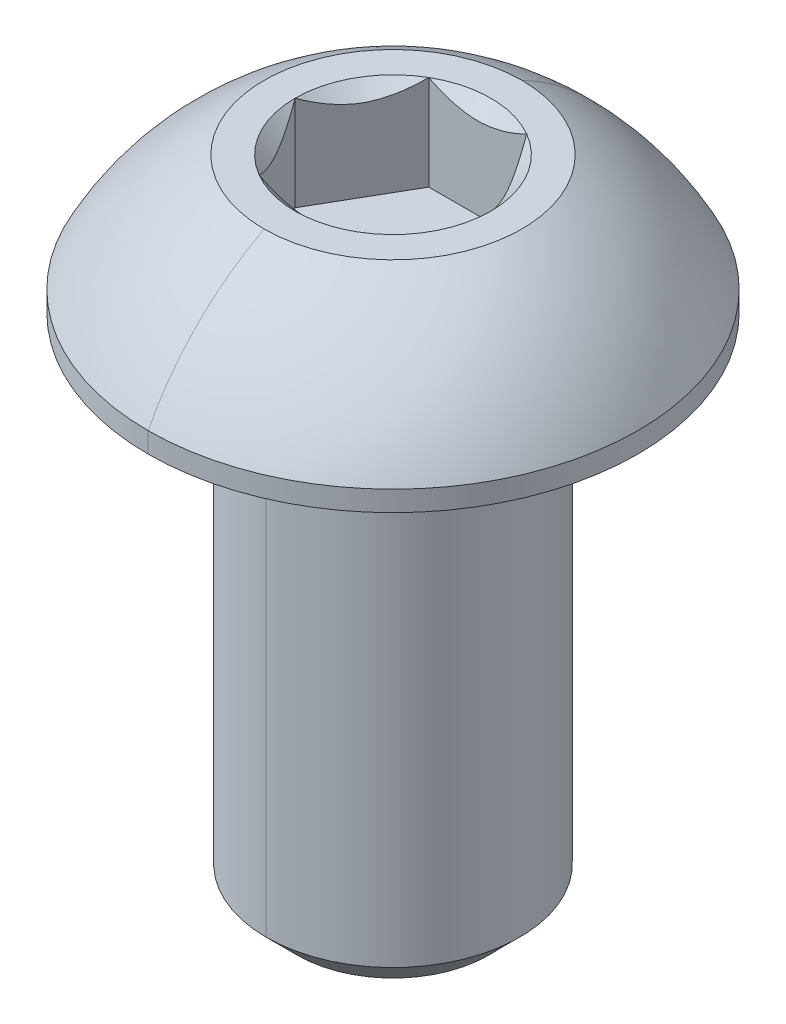
ISO-10303-21;
HEADER;
FILE_DESCRIPTION(('STEP AP214'),'2;1');
FILE_NAME('part.step','',(''),(''),'','','');
FILE_SCHEMA(('AUTOMOTIVE_DESIGN { 1 0 10303 214 1 1 1 1 }'));
ENDSEC;
DATA;
#1=APPLICATION_CONTEXT('core data for automotive mechanical design processes');
#2=APPLICATION_PROTOCOL_DEFINITION('international standard','automotive_design',2000,#1);
#3=PRODUCT_CONTEXT('',#1,'mechanical');
#4=PRODUCT('Part','Part','',(#3));
#5=PRODUCT_RELATED_PRODUCT_CATEGORY('part','',(#4));
#6=PRODUCT_DEFINITION_FORMATION('','',#4);
#7=PRODUCT_DEFINITION_CONTEXT('part definition',#1,'design');
#8=PRODUCT_DEFINITION('design','',#6,#7);
#9=PRODUCT_DEFINITION_SHAPE('','',#8);
#10=(LENGTH_UNIT() NAMED_UNIT(*) SI_UNIT(.MILLI.,.METRE.));
#11=(NAMED_UNIT(*) PLANE_ANGLE_UNIT() SI_UNIT($,.RADIAN.));
#12=(NAMED_UNIT(*) SI_UNIT($,.STERADIAN.) SOLID_ANGLE_UNIT());
#13=UNCERTAINTY_MEASURE_WITH_UNIT(LENGTH_MEASURE(1.E-05),#10,'distance_accuracy_value','');
#14=(GEOMETRIC_REPRESENTATION_CONTEXT(3) GLOBAL_UNCERTAINTY_ASSIGNED_CONTEXT((#13)) GLOBAL_UNIT_ASSIGNED_CONTEXT((#10,
#11,#12)) REPRESENTATION_CONTEXT('',''));
#15=CARTESIAN_POINT('',(0.,0.,0.));
#16=DIRECTION('',(0.,0.,1.));
#17=DIRECTION('',(1.,0.,0.));
#18=AXIS2_PLACEMENT_3D('',#15,#16,#17);
#19=CARTESIAN_POINT('',(2.83106871279415E-12,-0.152400000000052,-6.93889390390723E-13));
#20=DIRECTION('',(0.,1.,0.));
#21=DIRECTION('',(0.,0.,1.));
#22=AXIS2_PLACEMENT_3D('',#19,#20,#21);
#23=TOROIDAL_SURFACE('',#22,2.5273,0.1524);
#24=CARTESIAN_POINT('',(2.8832867508072E-12,-0.152400000000065,-2.52730000000004));
#25=DIRECTION('',(1.,0.,0.));
#26=DIRECTION('',(0.,1.,0.));
#27=AXIS2_PLACEMENT_3D('',#24,#25,#26);
#28=CIRCLE('',#27,0.1524);
#29=CARTESIAN_POINT('',(2.88750824063157E-12,0.,-2.5272999999997));
#30=VERTEX_POINT('',#29);
#31=CARTESIAN_POINT('',(8.02568049420078E-12,-0.152400000000048,-2.3749000000007));
#32=VERTEX_POINT('',#31);
#33=EDGE_CURVE('E258',#30,#32,#28,.T.);
#34=ORIENTED_EDGE('',*,*,#33,.F.);
#35=CARTESIAN_POINT('',(0.,0.,0.));
#36=DIRECTION('',(0.,1.,0.));
#37=DIRECTION('',(0.,0.,1.));
#38=AXIS2_PLACEMENT_3D('',#35,#36,#37);
#39=CIRCLE('',#38,2.52729999999935);
#40=CARTESIAN_POINT('',(2.78338166959102E-12,0.,2.527299999999));
#41=VERTEX_POINT('',#40);
#42=EDGE_CURVE('E182',#41,#30,#39,.T.);
#43=ORIENTED_EDGE('',*,*,#42,.F.);
#44=CARTESIAN_POINT('',(2.77916017976665E-12,-0.15240000000004,2.52729999999866));
#45=DIRECTION('',(-1.,0.,0.));
#46=DIRECTION('',(0.,-1.,0.));
#47=AXIS2_PLACEMENT_3D('',#44,#45,#46);
#48=CIRCLE('',#47,0.1524);
#49=CARTESIAN_POINT('',(2.78229034256228E-12,-0.152400000000041,2.3748999999987));
#50=VERTEX_POINT('',#49);
#51=EDGE_CURVE('E249',#41,#50,#48,.T.);
#52=ORIENTED_EDGE('',*,*,#51,.T.);
#53=CARTESIAN_POINT('',(2.83106871279415E-12,-0.152400000000052,-6.93889390390723E-13));
#54=DIRECTION('',(0.,-1.,0.));
#55=DIRECTION('',(0.,0.,1.));
#56=AXIS2_PLACEMENT_3D('',#53,#54,#55);
#57=CIRCLE('',#56,2.37489999999939);
#58=EDGE_CURVE('E235',#32,#50,#57,.T.);
#59=ORIENTED_EDGE('',*,*,#58,.F.);
#60=EDGE_LOOP('',(#34,#43,#52,#59));
#61=FACE_BOUND('',#60,.T.);
#62=ADVANCED_FACE('F16',(#61),#23,.F.);
#63=CARTESIAN_POINT('',(3.98292510084275E-12,2.56539999999183,0.));
#64=DIRECTION('',(0.,1.,0.));
#65=DIRECTION('',(0.,0.,1.));
#66=AXIS2_PLACEMENT_3D('',#63,#64,#65);
#67=CONICAL_SURFACE('',#66,1.83308710467659,0.78539816339745);
#68=DIRECTION('',(0.,0.707106781186531,-0.707106781186564));
#69=VECTOR('',#68,1.);
#70=CARTESIAN_POINT('',(4.02079959619876E-12,2.56539999999183,-1.83308710467666));
#71=LINE('',#70,#69);
#72=CARTESIAN_POINT('',(1.8249290967276E-12,0.732312895322496,-8.04911692853239E-13));
#73=VERTEX_POINT('',#72);
#74=CARTESIAN_POINT('',(3.93481257343155E-12,0.7874,-0.0550871046847421));
#75=VERTEX_POINT('',#74);
#76=EDGE_CURVE('E248',#73,#75,#71,.T.);
#77=ORIENTED_EDGE('',*,*,#76,.F.);
#78=DIRECTION('',(0.,0.707106781186533,0.707106781186562));
#79=VECTOR('',#78,1.);
#80=CARTESIAN_POINT('',(3.94527509391227E-12,2.56539999999184,1.83308710467652));
#81=LINE('',#80,#79);
#82=CARTESIAN_POINT('',(3.93254294524362E-12,0.7874,0.0550871046845962));
#83=VERTEX_POINT('',#82);
#84=EDGE_CURVE('E244',#73,#83,#81,.T.);
#85=ORIENTED_EDGE('',*,*,#84,.T.);
#86=CARTESIAN_POINT('',(9.29811783123569E-12,0.7874,-7.49400541621981E-13));
#87=DIRECTION('',(0.,1.,0.));
#88=DIRECTION('',(0.,0.,1.));
#89=AXIS2_PLACEMENT_3D('',#86,#87,#88);
#90=CIRCLE('',#89,0.0550871046770416);
#91=EDGE_CURVE('E265',#83,#75,#90,.T.);
#92=ORIENTED_EDGE('',*,*,#91,.T.);
#93=EDGE_LOOP('',(#77,#85,#92));
#94=FACE_BOUND('',#93,.T.);
#95=ADVANCED_FACE('F308',(#94),#67,.F.);
#96=CARTESIAN_POINT('',(1.83308710467573,0.787400000002103,5.27355936696949E-13));
#97=DIRECTION('',(0.86602540378436,0.,-0.500000000000136));
#98=DIRECTION('',(0.,-1.,0.));
#99=AXIS2_PLACEMENT_3D('',#96,#97,#98);
#100=PLANE('',#99);
#101=DIRECTION('',(0.,1.,0.));
#102=VECTOR('',#101,1.);
#103=CARTESIAN_POINT('',(1.83308710467573,0.787400000002103,5.27355936696949E-13));
#104=LINE('',#103,#102);
#105=CARTESIAN_POINT('',(1.83308710467573,0.787400000002103,5.27355936696949E-13));
#106=VERTEX_POINT('',#105);
#107=CARTESIAN_POINT('',(1.83308710467378,2.56539999999638,3.66373598126302E-12));
#108=VERTEX_POINT('',#107);
#109=EDGE_CURVE('E11',#106,#108,#104,.T.);
#110=ORIENTED_EDGE('',*,*,#109,.T.);
#111=CARTESIAN_POINT('',(1.83308710467658,2.56539999999639,2.04862599755152E-12));
#112=CARTESIAN_POINT('',(1.58854939318227,2.32086228847022,-0.423551740672565));
#113=CARTESIAN_POINT('',(1.37650342717792,2.31981648545018,-0.790826127331997));
#114=CARTESIAN_POINT('',(1.16317917434986,2.31876437796585,-1.16031457171672));
#115=CARTESIAN_POINT('',(0.916543552336051,2.56539999999961,-1.58750000000084));
#116=B_SPLINE_CURVE_WITH_KNOTS('',2,(#111,#112,#113,#114,#115),.UNSPECIFIED.,.F.,.F.,(3,2,3),
(0.,0.5,1.),.UNSPECIFIED.);
#117=CARTESIAN_POINT('',(0.916543552339173,2.5653999999996,-1.58750000000264));
#118=VERTEX_POINT('',#117);
#119=EDGE_CURVE('E290',#108,#118,#116,.T.);
#120=ORIENTED_EDGE('',*,*,#119,.T.);
#121=DIRECTION('',(0.,1.,0.));
#122=VECTOR('',#121,1.);
#123=CARTESIAN_POINT('',(0.916543552343552,0.787399999997551,-1.58750000000298));
#124=LINE('',#123,#122);
#125=CARTESIAN_POINT('',(0.916543552343552,0.787399999997551,-1.58750000000298));
#126=VERTEX_POINT('',#125);
#127=EDGE_CURVE('E340',#126,#118,#124,.T.);
#128=ORIENTED_EDGE('',*,*,#127,.F.);
#129=DIRECTION('',(-0.500000000000136,0.,-0.86602540378436));
#130=VECTOR('',#129,1.);
#131=CARTESIAN_POINT('',(1.83308710467573,0.787400000002103,5.27355936696949E-13));
#132=LINE('',#131,#130);
#133=EDGE_CURVE('E559',#106,#126,#132,.T.);
#134=ORIENTED_EDGE('',*,*,#133,.F.);
#135=EDGE_LOOP('',(#110,#120,#128,#134));
#136=FACE_BOUND('',#135,.T.);
#137=ADVANCED_FACE('F297',(#136),#100,.F.);
#138=CARTESIAN_POINT('',(0.916543552335766,0.787399999997222,1.58749999999671));
#139=DIRECTION('',(0.86602540378436,0.,0.500000000000136));
#140=DIRECTION('',(0.,-1.,0.));
#141=AXIS2_PLACEMENT_3D('',#138,#139,#140);
#142=PLANE('',#141);
#143=DIRECTION('',(0.,1.,0.));
#144=VECTOR('',#143,1.);
#145=CARTESIAN_POINT('',(0.916543552335766,0.787399999997222,1.58749999999671));
#146=LINE('',#145,#144);
#147=CARTESIAN_POINT('',(0.916543552335766,0.787399999997222,1.58749999999671));
#148=VERTEX_POINT('',#147);
#149=CARTESIAN_POINT('',(0.916543552334878,2.56539999999506,1.58749999999603));
#150=VERTEX_POINT('',#149);
#151=EDGE_CURVE('E29',#148,#150,#146,.T.);
#152=ORIENTED_EDGE('',*,*,#151,.T.);
#153=CARTESIAN_POINT('',(0.916543552335807,2.56539999999506,1.58749999999656));
#154=CARTESIAN_POINT('',(1.16108126382824,2.32086228846858,1.1639482593252));
#155=CARTESIAN_POINT('',(1.3731272298324,2.31981648544734,0.79667387266612));
#156=CARTESIAN_POINT('',(1.58645148266349,2.3187643779618,0.427185428276136));
#157=CARTESIAN_POINT('',(1.83308710467137,2.56539999999639,2.26988566831565E-12));
#158=B_SPLINE_CURVE_WITH_KNOTS('',2,(#153,#154,#155,#156,#157),.UNSPECIFIED.,.F.,.F.,(3,2,3),
(0.,0.5,1.),.UNSPECIFIED.);
#159=EDGE_CURVE('E586',#150,#108,#158,.T.);
#160=ORIENTED_EDGE('',*,*,#159,.T.);
#161=ORIENTED_EDGE('',*,*,#109,.F.);
#162=DIRECTION('',(0.500000000000143,0.,-0.866025403784356));
#163=VECTOR('',#162,1.);
#164=CARTESIAN_POINT('',(0.916543552335766,0.787399999997222,1.58749999999671));
#165=LINE('',#164,#163);
#166=EDGE_CURVE('E225',#148,#106,#165,.T.);
#167=ORIENTED_EDGE('',*,*,#166,.F.);
#168=EDGE_LOOP('',(#152,#160,#161,#167));
#169=FACE_BOUND('',#168,.T.);
#170=ADVANCED_FACE('F307',(#169),#142,.F.);
#171=CARTESIAN_POINT('',(-0.916543552338632,0.787399999991667,1.58750000000017));
#172=DIRECTION('',(0.,0.,1.));
#173=DIRECTION('',(1.,0.,0.));
#174=AXIS2_PLACEMENT_3D('',#171,#172,#173);
#175=PLANE('',#174);
#176=DIRECTION('',(0.,1.,0.));
#177=VECTOR('',#176,1.);
#178=CARTESIAN_POINT('',(-0.916543552338632,0.787399999991667,1.58750000000017));
#179=LINE('',#178,#177);
#180=CARTESIAN_POINT('',(-0.916543552338632,0.787399999991667,1.58750000000017));
#181=VERTEX_POINT('',#180);
#182=CARTESIAN_POINT('',(-0.916543552337397,2.56539999999461,1.58750000000156));
#183=VERTEX_POINT('',#182);
#184=EDGE_CURVE('E119',#181,#183,#179,.T.);
#185=ORIENTED_EDGE('',*,*,#184,.T.);
#186=CARTESIAN_POINT('',(-0.916543552337397,2.56539999999461,1.58750000000016));
#187=CARTESIAN_POINT('',(-0.684381010740348,2.4493187291939,1.58750000000015));
#188=CARTESIAN_POINT('',(-0.471873863885099,2.38845938443409,1.58750000000015));
#189=CARTESIAN_POINT('',(-0.232175759971701,2.31981289531495,1.58750000000014));
#190=CARTESIAN_POINT('',(3.94400224285052E-12,2.31981289531495,1.58750000000014));
#191=B_SPLINE_CURVE_WITH_KNOTS('',2,(#186,#187,#188,#189,#190),.UNSPECIFIED.,.F.,.F.,(3,2,3),
(0.,0.5,1.),.UNSPECIFIED.);
#192=CARTESIAN_POINT('',(3.94351645975641E-12,2.31981289531495,1.58750000000018));
#193=VERTEX_POINT('',#192);
#194=EDGE_CURVE('E607',#183,#193,#191,.T.);
#195=ORIENTED_EDGE('',*,*,#194,.T.);
#196=CARTESIAN_POINT('',(3.94400224285052E-12,2.31981289531495,1.58750000000014));
#197=CARTESIAN_POINT('',(0.229732695647818,2.31981289531495,1.58750000000013));
#198=CARTESIAN_POINT('',(0.471961624215618,2.38848439148555,1.58750000000013));
#199=CARTESIAN_POINT('',(0.681545943264558,2.447901195449,1.58750000000012));
#200=CARTESIAN_POINT('',(0.916543552334878,2.56539999999506,1.58750000000012));
#201=B_SPLINE_CURVE_WITH_KNOTS('',2,(#196,#197,#198,#199,#200),.UNSPECIFIED.,.F.,.F.,(3,2,3),
(0.,0.5,1.),.UNSPECIFIED.);
#202=EDGE_CURVE('E447',#193,#150,#201,.T.);
#203=ORIENTED_EDGE('',*,*,#202,.T.);
#204=ORIENTED_EDGE('',*,*,#151,.F.);
#205=DIRECTION('',(1.,0.,0.));
#206=VECTOR('',#205,1.);
#207=CARTESIAN_POINT('',(-0.916543552338632,0.787399999991667,1.58750000000017));
#208=LINE('',#207,#206);
#209=EDGE_CURVE('E221',#181,#148,#208,.T.);
#210=ORIENTED_EDGE('',*,*,#209,.F.);
#211=EDGE_LOOP('',(#185,#195,#203,#204,#210));
#212=FACE_BOUND('',#211,.T.);
#213=ADVANCED_FACE('F464',(#212),#175,.F.);
#214=CARTESIAN_POINT('',(-1.83308710468298,0.78739999999744,-6.80011602582908E-13));
#215=DIRECTION('',(-0.86602540378436,0.,0.500000000000136));
#216=DIRECTION('',(0.,1.,0.));
#217=AXIS2_PLACEMENT_3D('',#214,#215,#216);
#218=PLANE('',#217);
#219=DIRECTION('',(0.,1.,0.));
#220=VECTOR('',#219,1.);
#221=CARTESIAN_POINT('',(-1.83308710468298,0.78739999999744,-6.80011602582908E-13));
#222=LINE('',#221,#220);
#223=CARTESIAN_POINT('',(-1.83308710468298,0.78739999999744,-6.80011602582908E-13));
#224=VERTEX_POINT('',#223);
#225=CARTESIAN_POINT('',(-1.83308710468242,2.56539999999439,-1.84574577843933E-12));
#226=VERTEX_POINT('',#225);
#227=EDGE_CURVE('E339',#224,#226,#222,.T.);
#228=ORIENTED_EDGE('',*,*,#227,.T.);
#229=CARTESIAN_POINT('',(-1.83308710468336,2.56539999999439,-1.29646962342279E-12));
#230=CARTESIAN_POINT('',(-1.58854939314693,2.3208622884847,0.423551740746268));
#231=CARTESIAN_POINT('',(-1.37650342718448,2.31981648546347,0.790826127333117));
#232=CARTESIAN_POINT('',(-1.16317917436656,2.31876437797778,1.16031457170029));
#233=CARTESIAN_POINT('',(-0.916543552341487,2.56539999999461,1.58750000000392));
#234=B_SPLINE_CURVE_WITH_KNOTS('',2,(#229,#230,#231,#232,#233),.UNSPECIFIED.,.F.,.F.,(3,2,3),
(0.,0.5,1.),.UNSPECIFIED.);
#235=EDGE_CURVE('E452',#226,#183,#234,.T.);
#236=ORIENTED_EDGE('',*,*,#235,.T.);
#237=ORIENTED_EDGE('',*,*,#184,.F.);
#238=DIRECTION('',(0.500000000000136,0.,0.86602540378436));
#239=VECTOR('',#238,1.);
#240=CARTESIAN_POINT('',(-1.83308710468298,0.78739999999744,-6.80011602582908E-13));
#241=LINE('',#240,#239);
#242=EDGE_CURVE('E226',#224,#181,#241,.T.);
#243=ORIENTED_EDGE('',*,*,#242,.F.);
#244=EDGE_LOOP('',(#228,#236,#237,#243));
#245=FACE_BOUND('',#244,.T.);
#246=ADVANCED_FACE('F369',(#245),#218,.F.);
#247=CARTESIAN_POINT('',(-0.916543552339749,0.787399999997662,-1.5875));
#248=DIRECTION('',(-0.86602540378436,0.,-0.500000000000137));
#249=DIRECTION('',(-0.500000000000137,0.,0.86602540378436));
#250=AXIS2_PLACEMENT_3D('',#247,#248,#249);
#251=PLANE('',#250);
#252=DIRECTION('',(0.,1.,0.));
#253=VECTOR('',#252,1.);
#254=CARTESIAN_POINT('',(-0.916543552339749,0.787399999997662,-1.5875));
#255=LINE('',#254,#253);
#256=CARTESIAN_POINT('',(-0.916543552339749,0.787399999997662,-1.5875));
#257=VERTEX_POINT('',#256);
#258=CARTESIAN_POINT('',(-0.916543552337917,2.56539999999927,-1.58749999999746));
#259=VERTEX_POINT('',#258);
#260=EDGE_CURVE('E331',#257,#259,#255,.T.);
#261=ORIENTED_EDGE('',*,*,#260,.T.);
#262=CARTESIAN_POINT('',(-0.916543552340428,2.56539999999927,-1.5874999999989));
#263=CARTESIAN_POINT('',(-1.16108126384284,2.32086228847914,-1.16394825931025));
#264=CARTESIAN_POINT('',(-1.37312722983677,2.3198164854594,-0.796673872668863));
#265=CARTESIAN_POINT('',(-1.58645148265601,2.31876437797538,-0.427185428299416));
#266=CARTESIAN_POINT('',(-1.8330871046788,2.56539999999439,2.56305393575573E-13));
#267=B_SPLINE_CURVE_WITH_KNOTS('',2,(#262,#263,#264,#265,#266),.UNSPECIFIED.,.F.,.F.,(3,2,3),
(0.,0.5,1.),.UNSPECIFIED.);
#268=EDGE_CURVE('E383',#259,#226,#267,.T.);
#269=ORIENTED_EDGE('',*,*,#268,.T.);
#270=ORIENTED_EDGE('',*,*,#227,.F.);
#271=DIRECTION('',(-0.500000000000137,0.,0.86602540378436));
#272=VECTOR('',#271,1.);
#273=CARTESIAN_POINT('',(-0.916543552339749,0.787399999997662,-1.5875));
#274=LINE('',#273,#272);
#275=EDGE_CURVE('E230',#257,#224,#274,.T.);
#276=ORIENTED_EDGE('',*,*,#275,.F.);
#277=EDGE_LOOP('',(#261,#269,#270,#276));
#278=FACE_BOUND('',#277,.T.);
#279=ADVANCED_FACE('F363',(#278),#251,.F.);
#280=CARTESIAN_POINT('',(0.916543552343552,0.787399999997551,-1.58750000000298));
#281=DIRECTION('',(0.,0.,-1.));
#282=DIRECTION('',(-1.,0.,0.));
#283=AXIS2_PLACEMENT_3D('',#280,#281,#282);
#284=PLANE('',#283);
#285=ORIENTED_EDGE('',*,*,#127,.T.);
#286=CARTESIAN_POINT('',(0.916543552339173,2.56539999999961,-1.58750000000299));
#287=CARTESIAN_POINT('',(0.683300238168034,2.44877834290279,-1.58750000000298));
#288=CARTESIAN_POINT('',(0.472022049768518,2.38850161205948,-1.58750000000298));
#289=CARTESIAN_POINT('',(0.231606862065297,2.31991222443927,-1.58750000000297));
#290=CARTESIAN_POINT('',(0.000126990618810972,2.31981290039689,-1.58750000000297));
#291=CARTESIAN_POINT('',(-0.230319895795272,2.31971401959067,-1.58750000000296));
#292=CARTESIAN_POINT('',(-0.471813597713368,2.38844221423894,-1.58750000000296));
#293=CARTESIAN_POINT('',(-0.682613944370018,2.44843519600976,-1.58750000000295));
#294=CARTESIAN_POINT('',(-0.916543552337918,2.56539999999927,-1.58750000000295));
#295=B_SPLINE_CURVE_WITH_KNOTS('',2,(#286,#287,#288,#289,#290,#291,#292,#293,#294),
.UNSPECIFIED.,.F.,.F.,(3,2,2,2,3),(0.,0.25,0.5,0.75,1.),.UNSPECIFIED.);
#296=EDGE_CURVE('E347',#118,#259,#295,.T.);
#297=ORIENTED_EDGE('',*,*,#296,.T.);
#298=ORIENTED_EDGE('',*,*,#260,.F.);
#299=DIRECTION('',(-1.,0.,0.));
#300=VECTOR('',#299,1.);
#301=CARTESIAN_POINT('',(0.916543552343552,0.787399999997551,-1.58750000000298));
#302=LINE('',#301,#300);
#303=EDGE_CURVE('E277',#126,#257,#302,.T.);
#304=ORIENTED_EDGE('',*,*,#303,.F.);
#305=EDGE_LOOP('',(#285,#297,#298,#304));
#306=FACE_BOUND('',#305,.T.);
#307=ADVANCED_FACE('F314',(#306),#284,.F.);
#308=CARTESIAN_POINT('',(9.29811783123569E-12,0.7874,-7.49400541621981E-13));
#309=DIRECTION('',(0.,1.,0.));
#310=DIRECTION('',(1.,0.,0.));
#311=AXIS2_PLACEMENT_3D('',#308,#309,#310);
#312=PLANE('',#311);
#313=ORIENTED_EDGE('',*,*,#91,.F.);
#314=CARTESIAN_POINT('',(9.29811783123569E-12,0.7874,-7.49400541621981E-13));
#315=DIRECTION('',(0.,1.,0.));
#316=DIRECTION('',(0.,0.,1.));
#317=AXIS2_PLACEMENT_3D('',#314,#315,#316);
#318=CIRCLE('',#317,0.0550871046770416);
#319=EDGE_CURVE('E540',#75,#83,#318,.T.);
#320=ORIENTED_EDGE('',*,*,#319,.F.);
#321=EDGE_LOOP('',(#313,#320));
#322=FACE_BOUND('',#321,.T.);
#323=ORIENTED_EDGE('',*,*,#133,.T.);
#324=ORIENTED_EDGE('',*,*,#303,.T.);
#325=ORIENTED_EDGE('',*,*,#275,.T.);
#326=ORIENTED_EDGE('',*,*,#242,.T.);
#327=ORIENTED_EDGE('',*,*,#209,.T.);
#328=ORIENTED_EDGE('',*,*,#166,.T.);
#329=EDGE_LOOP('',(#323,#324,#325,#326,#327,#328));
#330=FACE_BOUND('',#329,.T.);
#331=ADVANCED_FACE('F310',(#322,#330),#312,.T.);
#332=CARTESIAN_POINT('',(3.98292510084275E-12,2.56539999999183,0.));
#333=DIRECTION('',(0.,1.,0.));
#334=DIRECTION('',(0.,0.,1.));
#335=AXIS2_PLACEMENT_3D('',#332,#333,#334);
#336=CONICAL_SURFACE('',#335,1.83308710467659,0.78539816339745);
#337=CARTESIAN_POINT('',(3.98292510084275E-12,2.56539999999183,0.));
#338=DIRECTION('',(0.,1.,0.));
#339=DIRECTION('',(0.,0.,1.));
#340=AXIS2_PLACEMENT_3D('',#337,#338,#339);
#341=CIRCLE('',#340,1.83308710467659);
#342=EDGE_CURVE('E579',#108,#118,#341,.T.);
#343=ORIENTED_EDGE('',*,*,#342,.T.);
#344=ORIENTED_EDGE('',*,*,#119,.F.);
#345=EDGE_LOOP('',(#343,#344));
#346=FACE_BOUND('',#345,.T.);
#347=ADVANCED_FACE('F313',(#346),#336,.F.);
#348=CARTESIAN_POINT('',(3.98292510084275E-12,2.56539999999183,0.));
#349=DIRECTION('',(0.,1.,0.));
#350=DIRECTION('',(0.,0.,1.));
#351=AXIS2_PLACEMENT_3D('',#348,#349,#350);
#352=CONICAL_SURFACE('',#351,1.83308710467659,0.78539816339745);
#353=CARTESIAN_POINT('',(3.98292510084275E-12,2.56539999999183,0.));
#354=DIRECTION('',(0.,1.,0.));
#355=DIRECTION('',(0.,0.,1.));
#356=AXIS2_PLACEMENT_3D('',#353,#354,#355);
#357=CIRCLE('',#356,1.83308710467659);
#358=EDGE_CURVE('E440',#150,#108,#357,.T.);
#359=ORIENTED_EDGE('',*,*,#358,.T.);
#360=ORIENTED_EDGE('',*,*,#159,.F.);
#361=EDGE_LOOP('',(#359,#360));
#362=FACE_BOUND('',#361,.T.);
#363=ADVANCED_FACE('F413',(#362),#352,.F.);
#364=CARTESIAN_POINT('',(3.98292510084275E-12,2.56539999999183,0.));
#365=DIRECTION('',(0.,1.,0.));
#366=DIRECTION('',(0.,0.,1.));
#367=AXIS2_PLACEMENT_3D('',#364,#365,#366);
#368=CONICAL_SURFACE('',#367,1.83308710467659,0.78539816339745);
#369=DIRECTION('',(0.,0.707106781186533,0.707106781186562));
#370=VECTOR('',#369,1.);
#371=CARTESIAN_POINT('',(3.94527509391227E-12,2.56539999999184,1.83308710467652));
#372=LINE('',#371,#370);
#373=CARTESIAN_POINT('',(3.94527509391227E-12,2.56539999999183,1.83308710467651));
#374=VERTEX_POINT('',#373);
#375=EDGE_CURVE('E443',#193,#374,#372,.T.);
#376=ORIENTED_EDGE('',*,*,#375,.F.);
#377=ORIENTED_EDGE('',*,*,#194,.F.);
#378=CARTESIAN_POINT('',(3.98292510084275E-12,2.56539999999183,0.));
#379=DIRECTION('',(0.,1.,0.));
#380=DIRECTION('',(0.,0.,1.));
#381=AXIS2_PLACEMENT_3D('',#378,#379,#380);
#382=CIRCLE('',#381,1.83308710467659);
#383=EDGE_CURVE('E435',#183,#374,#382,.T.);
#384=ORIENTED_EDGE('',*,*,#383,.T.);
#385=EDGE_LOOP('',(#376,#377,#384));
#386=FACE_BOUND('',#385,.T.);
#387=ADVANCED_FACE('F408',(#386),#368,.F.);
#388=CARTESIAN_POINT('',(3.98292510084275E-12,2.56539999999183,0.));
#389=DIRECTION('',(0.,1.,0.));
#390=DIRECTION('',(0.,0.,1.));
#391=AXIS2_PLACEMENT_3D('',#388,#389,#390);
#392=CONICAL_SURFACE('',#391,1.83308710467659,0.78539816339745);
#393=CARTESIAN_POINT('',(3.98292510084275E-12,2.56539999999183,0.));
#394=DIRECTION('',(0.,1.,0.));
#395=DIRECTION('',(0.,0.,1.));
#396=AXIS2_PLACEMENT_3D('',#393,#394,#395);
#397=CIRCLE('',#396,1.83308710467659);
#398=EDGE_CURVE('E390',#226,#183,#397,.T.);
#399=ORIENTED_EDGE('',*,*,#398,.T.);
#400=ORIENTED_EDGE('',*,*,#235,.F.);
#401=EDGE_LOOP('',(#399,#400));
#402=FACE_BOUND('',#401,.T.);
#403=ADVANCED_FACE('F321',(#402),#392,.F.);
#404=CARTESIAN_POINT('',(3.98292510084275E-12,2.56539999999183,0.));
#405=DIRECTION('',(0.,1.,0.));
#406=DIRECTION('',(0.,0.,1.));
#407=AXIS2_PLACEMENT_3D('',#404,#405,#406);
#408=CONICAL_SURFACE('',#407,1.83308710467659,0.78539816339745);
#409=CARTESIAN_POINT('',(3.98292510084275E-12,2.56539999999183,0.));
#410=DIRECTION('',(0.,1.,0.));
#411=DIRECTION('',(0.,0.,1.));
#412=AXIS2_PLACEMENT_3D('',#409,#410,#411);
#413=CIRCLE('',#412,1.83308710467659);
#414=EDGE_CURVE('E387',#259,#226,#413,.T.);
#415=ORIENTED_EDGE('',*,*,#414,.T.);
#416=ORIENTED_EDGE('',*,*,#268,.F.);
#417=EDGE_LOOP('',(#415,#416));
#418=FACE_BOUND('',#417,.T.);
#419=ADVANCED_FACE('F316',(#418),#408,.F.);
#420=CARTESIAN_POINT('',(3.98292510084275E-12,2.56539999999183,0.));
#421=DIRECTION('',(0.,1.,0.));
#422=DIRECTION('',(0.,0.,1.));
#423=AXIS2_PLACEMENT_3D('',#420,#421,#422);
#424=CONICAL_SURFACE('',#423,1.83308710467659,0.78539816339745);
#425=CARTESIAN_POINT('',(3.98292510084275E-12,2.56539999999183,0.));
#426=DIRECTION('',(0.,1.,0.));
#427=DIRECTION('',(0.,0.,1.));
#428=AXIS2_PLACEMENT_3D('',#425,#426,#427);
#429=CIRCLE('',#428,1.83308710467659);
#430=EDGE_CURVE('E239',#118,#259,#429,.T.);
#431=ORIENTED_EDGE('',*,*,#430,.T.);
#432=ORIENTED_EDGE('',*,*,#296,.F.);
#433=EDGE_LOOP('',(#431,#432));
#434=FACE_BOUND('',#433,.T.);
#435=ADVANCED_FACE('F320',(#434),#424,.F.);
#436=CARTESIAN_POINT('',(4.27435864480686E-12,2.56539999999683,-2.41299999999922));
#437=DIRECTION('',(0.,-1.,0.));
#438=DIRECTION('',(-1.,0.,0.));
#439=AXIS2_PLACEMENT_3D('',#436,#437,#438);
#440=PLANE('',#439);
#441=ORIENTED_EDGE('',*,*,#430,.F.);
#442=ORIENTED_EDGE('',*,*,#342,.F.);
#443=ORIENTED_EDGE('',*,*,#358,.F.);
#444=CARTESIAN_POINT('',(3.98292510084275E-12,2.56539999999183,0.));
#445=DIRECTION('',(0.,1.,0.));
#446=DIRECTION('',(0.,0.,1.));
#447=AXIS2_PLACEMENT_3D('',#444,#445,#446);
#448=CIRCLE('',#447,1.83308710467659);
#449=EDGE_CURVE('E273',#374,#150,#448,.T.);
#450=ORIENTED_EDGE('',*,*,#449,.F.);
#451=ORIENTED_EDGE('',*,*,#383,.F.);
#452=ORIENTED_EDGE('',*,*,#398,.F.);
#453=ORIENTED_EDGE('',*,*,#414,.F.);
#454=EDGE_LOOP('',(#441,#442,#443,#450,#451,#452,#453));
#455=FACE_BOUND('',#454,.T.);
#456=CARTESIAN_POINT('',(3.98292510084275E-12,2.56539999999183,0.));
#457=DIRECTION('',(0.,1.,0.));
#458=DIRECTION('',(0.,0.,1.));
#459=AXIS2_PLACEMENT_3D('',#456,#457,#458);
#460=CIRCLE('',#459,2.41299999999937);
#461=CARTESIAN_POINT('',(3.93336418991197E-12,2.56539999999184,2.4129999999993));
#462=VERTEX_POINT('',#461);
#463=CARTESIAN_POINT('',(3.89995836190694E-12,2.56539999999184,-2.41300000000007));
#464=VERTEX_POINT('',#463);
#465=EDGE_CURVE('E205',#462,#464,#460,.T.);
#466=ORIENTED_EDGE('',*,*,#465,.T.);
#467=CARTESIAN_POINT('',(3.98292510084275E-12,2.56539999999183,0.));
#468=DIRECTION('',(0.,1.,0.));
#469=DIRECTION('',(0.,0.,1.));
#470=AXIS2_PLACEMENT_3D('',#467,#468,#469);
#471=CIRCLE('',#470,2.41299999999937);
#472=EDGE_CURVE('E236',#464,#462,#471,.T.);
#473=ORIENTED_EDGE('',*,*,#472,.T.);
#474=EDGE_LOOP('',(#466,#473));
#475=FACE_BOUND('',#474,.T.);
#476=ADVANCED_FACE('F610',(#455,#475),#440,.F.);
#477=CARTESIAN_POINT('',(3.73312492030209E-12,-1.93984747978082,-2.28983498828939E-12));
#478=DIRECTION('',(0.,1.,0.));
#479=DIRECTION('',(0.,0.,1.));
#480=AXIS2_PLACEMENT_3D('',#477,#478,#479);
#481=DEGENERATE_TOROIDAL_SURFACE('',#480,0.065843178235288,5.08,.T.);
#482=CARTESIAN_POINT('',(3.73448534509693E-12,-1.93984747978082,-0.0658431782375608));
#483=DIRECTION('',(1.,0.,0.));
#484=DIRECTION('',(0.,1.,0.));
#485=AXIS2_PLACEMENT_3D('',#482,#483,#484);
#486=CIRCLE('',#485,5.08);
#487=CARTESIAN_POINT('',(4.01186741233054E-12,0.380999999995532,-4.58470000000178));
#488=VERTEX_POINT('',#487);
#489=EDGE_CURVE('E252',#488,#464,#486,.T.);
#490=ORIENTED_EDGE('',*,*,#489,.F.);
#491=CARTESIAN_POINT('',(7.79237785408782E-12,0.380999999995524,-1.77635683940025E-12));
#492=DIRECTION('',(0.,1.,0.));
#493=DIRECTION('',(0.,0.,1.));
#494=AXIS2_PLACEMENT_3D('',#491,#492,#493);
#495=CIRCLE('',#494,4.58469999999882);
#496=CARTESIAN_POINT('',(7.69821212331934E-12,0.380999999995546,4.58469999999704));
#497=VERTEX_POINT('',#496);
#498=EDGE_CURVE('E240',#488,#497,#495,.T.);
#499=ORIENTED_EDGE('',*,*,#498,.T.);
#500=CARTESIAN_POINT('',(3.731772558971E-12,-1.93984747978082,0.0658431782329811));
#501=DIRECTION('',(-1.,0.,0.));
#502=DIRECTION('',(0.,-1.,0.));
#503=AXIS2_PLACEMENT_3D('',#500,#501,#502);
#504=CIRCLE('',#503,5.08);
#505=EDGE_CURVE('E196',#497,#462,#504,.T.);
#506=ORIENTED_EDGE('',*,*,#505,.T.);
#507=ORIENTED_EDGE('',*,*,#472,.F.);
#508=EDGE_LOOP('',(#490,#499,#506,#507));
#509=FACE_BOUND('',#508,.T.);
#510=ADVANCED_FACE('F518',(#509),#481,.T.);
#511=CARTESIAN_POINT('',(3.98292510084275E-12,2.56539999999183,0.));
#512=DIRECTION('',(0.,1.,0.));
#513=DIRECTION('',(0.,0.,1.));
#514=AXIS2_PLACEMENT_3D('',#511,#512,#513);
#515=CYLINDRICAL_SURFACE('',#514,4.58469999999882);
#516=DIRECTION('',(0.,1.,0.));
#517=VECTOR('',#516,1.);
#518=CARTESIAN_POINT('',(4.07765229542924E-12,2.56539999999181,-4.58469999999888));
#519=LINE('',#518,#517);
#520=CARTESIAN_POINT('',(4.01186741233391E-12,0.,-4.5847));
#521=VERTEX_POINT('',#520);
#522=EDGE_CURVE('E177',#521,#488,#519,.T.);
#523=ORIENTED_EDGE('',*,*,#522,.F.);
#524=CARTESIAN_POINT('',(0.,0.,0.));
#525=DIRECTION('',(0.,1.,0.));
#526=DIRECTION('',(0.,0.,1.));
#527=AXIS2_PLACEMENT_3D('',#524,#525,#526);
#528=CIRCLE('',#527,4.58469999999882);
#529=CARTESIAN_POINT('',(0.,0.,4.58469999999882));
#530=VERTEX_POINT('',#529);
#531=EDGE_CURVE('E171',#521,#530,#528,.T.);
#532=ORIENTED_EDGE('',*,*,#531,.T.);
#533=DIRECTION('',(0.,1.,0.));
#534=VECTOR('',#533,1.);
#535=CARTESIAN_POINT('',(3.88875937007427E-12,2.56539999999186,4.58469999999875));
#536=LINE('',#535,#534);
#537=EDGE_CURVE('E174',#530,#497,#536,.T.);
#538=ORIENTED_EDGE('',*,*,#537,.T.);
#539=ORIENTED_EDGE('',*,*,#498,.F.);
#540=EDGE_LOOP('',(#523,#532,#538,#539));
#541=FACE_BOUND('',#540,.T.);
#542=ADVANCED_FACE('F173',(#541),#515,.T.);
#543=CARTESIAN_POINT('',(0.,0.,0.));
#544=DIRECTION('',(0.,1.,0.));
#545=DIRECTION('',(1.,0.,0.));
#546=AXIS2_PLACEMENT_3D('',#543,#544,#545);
#547=PLANE('',#546);
#548=ORIENTED_EDGE('',*,*,#42,.T.);
#549=CARTESIAN_POINT('',(0.,0.,0.));
#550=DIRECTION('',(0.,1.,0.));
#551=DIRECTION('',(0.,0.,1.));
#552=AXIS2_PLACEMENT_3D('',#549,#550,#551);
#553=CIRCLE('',#552,2.52729999999935);
#554=EDGE_CURVE('E254',#30,#41,#553,.T.);
#555=ORIENTED_EDGE('',*,*,#554,.T.);
#556=EDGE_LOOP('',(#548,#555));
#557=FACE_BOUND('',#556,.T.);
#558=CARTESIAN_POINT('',(0.,0.,0.));
#559=DIRECTION('',(0.,1.,0.));
#560=DIRECTION('',(0.,0.,1.));
#561=AXIS2_PLACEMENT_3D('',#558,#559,#560);
#562=CIRCLE('',#561,4.58469999999882);
#563=EDGE_CURVE('E188',#530,#521,#562,.T.);
#564=ORIENTED_EDGE('',*,*,#563,.F.);
#565=ORIENTED_EDGE('',*,*,#531,.F.);
#566=EDGE_LOOP('',(#564,#565));
#567=FACE_BOUND('',#566,.T.);
#568=ADVANCED_FACE('F194',(#557,#567),#547,.F.);
#569=CARTESIAN_POINT('',(5.30131494258512E-12,-8.94080000000253,-9.15933995315754E-13));
#570=DIRECTION('',(0.,1.,0.));
#571=DIRECTION('',(0.,0.,1.));
#572=AXIS2_PLACEMENT_3D('',#569,#570,#571);
#573=CONICAL_SURFACE('',#572,2.37489999999939,0.78539816339745);
#574=DIRECTION('',(0.,0.707106781186531,-0.707106781186565));
#575=VECTOR('',#574,1.);
#576=CARTESIAN_POINT('',(5.35038415418533E-12,-8.94080000000254,-2.3749000000003));
#577=LINE('',#576,#575);
#578=CARTESIAN_POINT('',(5.33625771472754E-12,-9.52500000000233,-1.79070000000216));
#579=VERTEX_POINT('',#578);
#580=CARTESIAN_POINT('',(8.02568049420094E-12,-8.94080000000252,-2.37490000000092));
#581=VERTEX_POINT('',#580);
#582=EDGE_CURVE('E216',#579,#581,#577,.T.);
#583=ORIENTED_EDGE('',*,*,#582,.F.);
#584=CARTESIAN_POINT('',(7.83401121751126E-12,-9.52500000000234,-2.16493489801906E-12));
#585=DIRECTION('',(0.,-1.,0.));
#586=DIRECTION('',(0.,0.,1.));
#587=AXIS2_PLACEMENT_3D('',#584,#585,#586);
#588=CIRCLE('',#587,1.79069999999953);
#589=CARTESIAN_POINT('',(7.79723180466263E-12,-9.52500000000233,1.79069999999736));
#590=VERTEX_POINT('',#589);
#591=EDGE_CURVE('E183',#590,#579,#588,.T.);
#592=ORIENTED_EDGE('',*,*,#591,.F.);
#593=DIRECTION('',(0.,0.707106781186533,0.707106781186562));
#594=VECTOR('',#593,1.);
#595=CARTESIAN_POINT('',(5.25253657235325E-12,-8.94080000000251,2.37489999999847));
#596=LINE('',#595,#594);
#597=CARTESIAN_POINT('',(5.25253657235325E-12,-8.94080000000251,2.37489999999847));
#598=VERTEX_POINT('',#597);
#599=EDGE_CURVE('E215',#590,#598,#596,.T.);
#600=ORIENTED_EDGE('',*,*,#599,.T.);
#601=CARTESIAN_POINT('',(5.30131494258512E-12,-8.94080000000253,-9.15933995315754E-13));
#602=DIRECTION('',(0.,1.,0.));
#603=DIRECTION('',(0.,0.,1.));
#604=AXIS2_PLACEMENT_3D('',#601,#602,#603);
#605=CIRCLE('',#604,2.37489999999939);
#606=EDGE_CURVE('E217',#581,#598,#605,.T.);
#607=ORIENTED_EDGE('',*,*,#606,.F.);
#608=EDGE_LOOP('',(#583,#592,#600,#607));
#609=FACE_BOUND('',#608,.T.);
#610=ADVANCED_FACE('F485',(#609),#573,.T.);
#611=CARTESIAN_POINT('',(7.83401121751126E-12,-9.52500000000234,-2.16493489801906E-12));
#612=DIRECTION('',(0.,1.,0.));
#613=DIRECTION('',(1.,0.,0.));
#614=AXIS2_PLACEMENT_3D('',#611,#612,#613);
#615=PLANE('',#614);
#616=ORIENTED_EDGE('',*,*,#591,.T.);
#617=CARTESIAN_POINT('',(7.83401121751126E-12,-9.52500000000234,-2.16493489801906E-12));
#618=DIRECTION('',(0.,-1.,0.));
#619=DIRECTION('',(0.,0.,1.));
#620=AXIS2_PLACEMENT_3D('',#617,#618,#619);
#621=CIRCLE('',#620,1.79069999999953);
#622=EDGE_CURVE('E192',#579,#590,#621,.T.);
#623=ORIENTED_EDGE('',*,*,#622,.T.);
#624=EDGE_LOOP('',(#616,#623));
#625=FACE_BOUND('',#624,.T.);
#626=ADVANCED_FACE('F491',(#625),#615,.F.);
#627=CARTESIAN_POINT('',(7.83401121751126E-12,-9.52500000000234,-2.16493489801906E-12));
#628=DIRECTION('',(0.,1.,0.));
#629=DIRECTION('',(0.,0.,1.));
#630=AXIS2_PLACEMENT_3D('',#627,#628,#629);
#631=CYLINDRICAL_SURFACE('',#630,2.37489999999939);
#632=DIRECTION('',(0.,1.,0.));
#633=VECTOR('',#632,1.);
#634=CARTESIAN_POINT('',(7.88308042911147E-12,-9.52500000000235,-2.37490000000155));
#635=LINE('',#634,#633);
#636=EDGE_CURVE('E231',#581,#32,#635,.T.);
#637=ORIENTED_EDGE('',*,*,#636,.F.);
#638=ORIENTED_EDGE('',*,*,#606,.T.);
#639=DIRECTION('',(0.,1.,0.));
#640=VECTOR('',#639,1.);
#641=CARTESIAN_POINT('',(7.78523284727939E-12,-9.52500000000233,2.37489999999723));
#642=LINE('',#641,#640);
#643=EDGE_CURVE('E220',#598,#50,#642,.T.);
#644=ORIENTED_EDGE('',*,*,#643,.T.);
#645=CARTESIAN_POINT('',(2.83106871279415E-12,-0.152400000000052,-6.93889390390723E-13));
#646=DIRECTION('',(0.,-1.,0.));
#647=DIRECTION('',(0.,0.,1.));
#648=AXIS2_PLACEMENT_3D('',#645,#646,#647);
#649=CIRCLE('',#648,2.37489999999939);
#650=EDGE_CURVE('E209',#50,#32,#649,.T.);
#651=ORIENTED_EDGE('',*,*,#650,.T.);
#652=EDGE_LOOP('',(#637,#638,#644,#651));
#653=FACE_BOUND('',#652,.T.);
#654=ADVANCED_FACE('F371',(#653),#631,.T.);
#655=CARTESIAN_POINT('',(7.83401121751126E-12,-9.52500000000234,-2.16493489801906E-12));
#656=DIRECTION('',(0.,1.,0.));
#657=DIRECTION('',(0.,0.,1.));
#658=AXIS2_PLACEMENT_3D('',#655,#656,#657);
#659=CYLINDRICAL_SURFACE('',#658,2.37489999999939);
#660=CARTESIAN_POINT('',(5.30131494258512E-12,-8.94080000000253,-9.15933995315754E-13));
#661=DIRECTION('',(0.,1.,0.));
#662=DIRECTION('',(0.,0.,1.));
#663=AXIS2_PLACEMENT_3D('',#660,#661,#662);
#664=CIRCLE('',#663,2.37489999999939);
#665=EDGE_CURVE('E211',#598,#581,#664,.T.);
#666=ORIENTED_EDGE('',*,*,#665,.T.);
#667=ORIENTED_EDGE('',*,*,#636,.T.);
#668=ORIENTED_EDGE('',*,*,#58,.T.);
#669=ORIENTED_EDGE('',*,*,#643,.F.);
#670=EDGE_LOOP('',(#666,#667,#668,#669));
#671=FACE_BOUND('',#670,.T.);
#672=ADVANCED_FACE('F415',(#671),#659,.T.);
#673=CARTESIAN_POINT('',(5.30131494258512E-12,-8.94080000000253,-9.15933995315754E-13));
#674=DIRECTION('',(0.,1.,0.));
#675=DIRECTION('',(0.,0.,1.));
#676=AXIS2_PLACEMENT_3D('',#673,#674,#675);
#677=CONICAL_SURFACE('',#676,2.37489999999939,0.78539816339745);
#678=ORIENTED_EDGE('',*,*,#622,.F.);
#679=ORIENTED_EDGE('',*,*,#582,.T.);
#680=ORIENTED_EDGE('',*,*,#665,.F.);
#681=ORIENTED_EDGE('',*,*,#599,.F.);
#682=EDGE_LOOP('',(#678,#679,#680,#681));
#683=FACE_BOUND('',#682,.T.);
#684=ADVANCED_FACE('F465',(#683),#677,.T.);
#685=CARTESIAN_POINT('',(3.98292510084275E-12,2.56539999999183,0.));
#686=DIRECTION('',(0.,1.,0.));
#687=DIRECTION('',(0.,0.,1.));
#688=AXIS2_PLACEMENT_3D('',#685,#686,#687);
#689=CYLINDRICAL_SURFACE('',#688,4.58469999999882);
#690=ORIENTED_EDGE('',*,*,#563,.T.);
#691=ORIENTED_EDGE('',*,*,#522,.T.);
#692=CARTESIAN_POINT('',(7.79237785408782E-12,0.380999999995524,-1.77635683940025E-12));
#693=DIRECTION('',(0.,1.,0.));
#694=DIRECTION('',(0.,0.,1.));
#695=AXIS2_PLACEMENT_3D('',#692,#693,#694);
#696=CIRCLE('',#695,4.58469999999882);
#697=EDGE_CURVE('E190',#497,#488,#696,.T.);
#698=ORIENTED_EDGE('',*,*,#697,.F.);
#699=ORIENTED_EDGE('',*,*,#537,.F.);
#700=EDGE_LOOP('',(#690,#691,#698,#699));
#701=FACE_BOUND('',#700,.T.);
#702=ADVANCED_FACE('F187',(#701),#689,.T.);
#703=CARTESIAN_POINT('',(3.73312492030209E-12,-1.93984747978082,-2.28983498828939E-12));
#704=DIRECTION('',(0.,1.,0.));
#705=DIRECTION('',(0.,0.,1.));
#706=AXIS2_PLACEMENT_3D('',#703,#704,#705);
#707=DEGENERATE_TOROIDAL_SURFACE('',#706,0.065843178235288,5.08,.T.);
#708=ORIENTED_EDGE('',*,*,#697,.T.);
#709=ORIENTED_EDGE('',*,*,#489,.T.);
#710=ORIENTED_EDGE('',*,*,#465,.F.);
#711=ORIENTED_EDGE('',*,*,#505,.F.);
#712=EDGE_LOOP('',(#708,#709,#710,#711));
#713=FACE_BOUND('',#712,.T.);
#714=ADVANCED_FACE('F364',(#713),#707,.T.);
#715=CARTESIAN_POINT('',(3.98292510084275E-12,2.56539999999183,0.));
#716=DIRECTION('',(0.,1.,0.));
#717=DIRECTION('',(0.,0.,1.));
#718=AXIS2_PLACEMENT_3D('',#715,#716,#717);
#719=CONICAL_SURFACE('',#718,1.83308710467659,0.78539816339745);
#720=ORIENTED_EDGE('',*,*,#202,.F.);
#721=ORIENTED_EDGE('',*,*,#375,.T.);
#722=ORIENTED_EDGE('',*,*,#449,.T.);
#723=EDGE_LOOP('',(#720,#721,#722));
#724=FACE_BOUND('',#723,.T.);
#725=ADVANCED_FACE('F18',(#724),#719,.F.);
#726=CARTESIAN_POINT('',(3.98292510084275E-12,2.56539999999183,0.));
#727=DIRECTION('',(0.,1.,0.));
#728=DIRECTION('',(0.,0.,1.));
#729=AXIS2_PLACEMENT_3D('',#726,#727,#728);
#730=CONICAL_SURFACE('',#729,1.83308710467659,0.78539816339745);
#731=ORIENTED_EDGE('',*,*,#84,.F.);
#732=ORIENTED_EDGE('',*,*,#76,.T.);
#733=ORIENTED_EDGE('',*,*,#319,.T.);
#734=EDGE_LOOP('',(#731,#732,#733));
#735=FACE_BOUND('',#734,.T.);
#736=ADVANCED_FACE('F489',(#735),#730,.F.);
#737=CARTESIAN_POINT('',(2.83106871279415E-12,-0.152400000000052,-6.93889390390723E-13));
#738=DIRECTION('',(0.,1.,0.));
#739=DIRECTION('',(0.,0.,1.));
#740=AXIS2_PLACEMENT_3D('',#737,#738,#739);
#741=TOROIDAL_SURFACE('',#740,2.5273,0.1524);
#742=ORIENTED_EDGE('',*,*,#554,.F.);
#743=ORIENTED_EDGE('',*,*,#33,.T.);
#744=ORIENTED_EDGE('',*,*,#650,.F.);
#745=ORIENTED_EDGE('',*,*,#51,.F.);
#746=EDGE_LOOP('',(#742,#743,#744,#745));
#747=FACE_BOUND('',#746,.T.);
#748=ADVANCED_FACE('F487',(#747),#741,.F.);
#749=CLOSED_SHELL('',(#62,#95,#137,#170,#213,#246,#279,#307,#331,#347,#363,#387,#403,#419,#435,
#476,#510,#542,#568,#610,#626,#654,#672,#684,#702,#714,#725,#736,#748));
#750=MANIFOLD_SOLID_BREP('B1',#749);
#751=ADVANCED_BREP_SHAPE_REPRESENTATION('',(#18,#750),#14);
#752=SHAPE_DEFINITION_REPRESENTATION(#9,#751);
ENDSEC;
END-ISO-10303-21;
